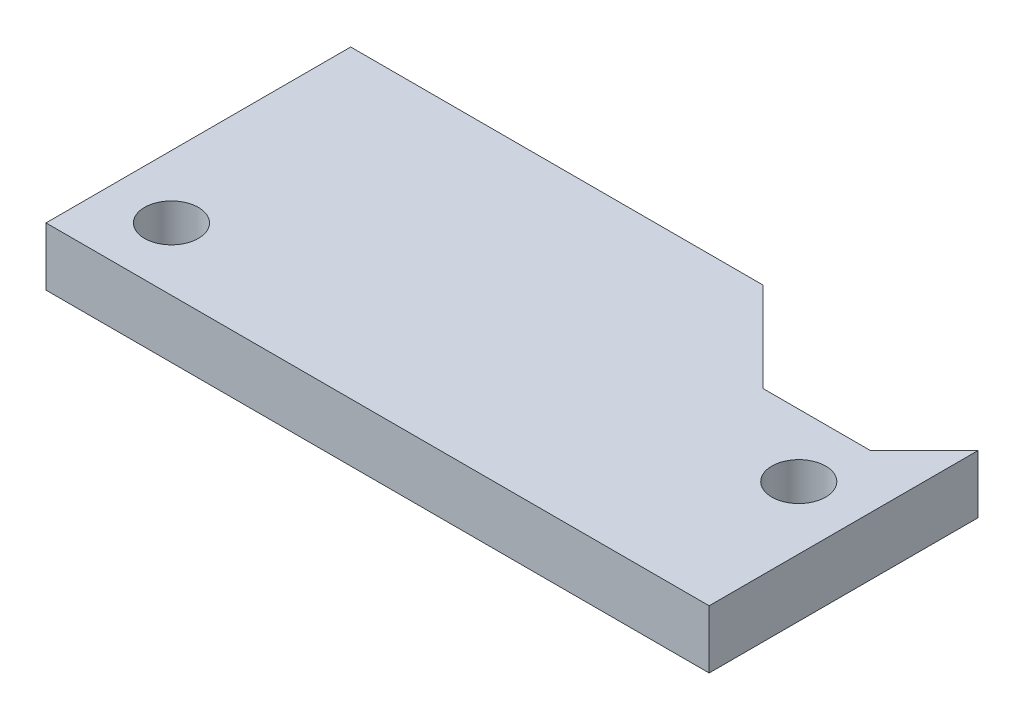
ISO-10303-21;
HEADER;
FILE_DESCRIPTION(('STEP AP214'),'2;1');
FILE_NAME('part.step','',(''),(''),'','','');
FILE_SCHEMA(('AUTOMOTIVE_DESIGN { 1 0 10303 214 1 1 1 1 }'));
ENDSEC;
DATA;
#1=APPLICATION_CONTEXT('core data for automotive mechanical design processes');
#2=APPLICATION_PROTOCOL_DEFINITION('international standard','automotive_design',2000,#1);
#3=PRODUCT_CONTEXT('',#1,'mechanical');
#4=PRODUCT('Part','Part','',(#3));
#5=PRODUCT_RELATED_PRODUCT_CATEGORY('part','',(#4));
#6=PRODUCT_DEFINITION_FORMATION('','',#4);
#7=PRODUCT_DEFINITION_CONTEXT('part definition',#1,'design');
#8=PRODUCT_DEFINITION('design','',#6,#7);
#9=PRODUCT_DEFINITION_SHAPE('','',#8);
#10=(LENGTH_UNIT() NAMED_UNIT(*) SI_UNIT(.MILLI.,.METRE.));
#11=(NAMED_UNIT(*) PLANE_ANGLE_UNIT() SI_UNIT($,.RADIAN.));
#12=(NAMED_UNIT(*) SI_UNIT($,.STERADIAN.) SOLID_ANGLE_UNIT());
#13=UNCERTAINTY_MEASURE_WITH_UNIT(LENGTH_MEASURE(1.E-05),#10,'distance_accuracy_value','');
#14=(GEOMETRIC_REPRESENTATION_CONTEXT(3) GLOBAL_UNCERTAINTY_ASSIGNED_CONTEXT((#13)) GLOBAL_UNIT_ASSIGNED_CONTEXT((#10,
#11,#12)) REPRESENTATION_CONTEXT('',''));
#15=CARTESIAN_POINT('',(0.,0.,0.));
#16=DIRECTION('',(0.,0.,1.));
#17=DIRECTION('',(1.,0.,0.));
#18=AXIS2_PLACEMENT_3D('',#15,#16,#17);
#19=CARTESIAN_POINT('',(0.,3.25,0.));
#20=DIRECTION('',(0.,1.,0.));
#21=DIRECTION('',(0.,0.,1.));
#22=AXIS2_PLACEMENT_3D('',#19,#20,#21);
#23=PLANE('',#22);
#24=CARTESIAN_POINT('',(-15.,3.25,5.00000000000001));
#25=DIRECTION('',(0.,1.,0.));
#26=DIRECTION('',(0.,0.,1.));
#27=AXIS2_PLACEMENT_3D('',#24,#25,#26);
#28=CIRCLE('',#27,1.5025);
#29=CARTESIAN_POINT('',(-15.,3.25,6.50250000000001));
#30=VERTEX_POINT('',#29);
#31=EDGE_CURVE('E129',#30,#30,#28,.T.);
#32=ORIENTED_EDGE('',*,*,#31,.F.);
#33=EDGE_LOOP('',(#32));
#34=FACE_BOUND('',#33,.T.);
#35=DIRECTION('',(0.,0.,1.));
#36=VECTOR('',#35,1.);
#37=CARTESIAN_POINT('',(-18.5,3.25,-8.49999999999999));
#38=LINE('',#37,#36);
#39=CARTESIAN_POINT('',(-18.5,3.25,-8.49999999999999));
#40=VERTEX_POINT('',#39);
#41=CARTESIAN_POINT('',(-18.5,3.25,8.50000000000001));
#42=VERTEX_POINT('',#41);
#43=EDGE_CURVE('E138',#40,#42,#38,.T.);
#44=ORIENTED_EDGE('',*,*,#43,.T.);
#45=DIRECTION('',(1.,0.,0.));
#46=VECTOR('',#45,1.);
#47=CARTESIAN_POINT('',(-18.5,3.25,8.50000000000001));
#48=LINE('',#47,#46);
#49=CARTESIAN_POINT('',(18.5,3.25,8.50000000000001));
#50=VERTEX_POINT('',#49);
#51=EDGE_CURVE('E91',#42,#50,#48,.T.);
#52=ORIENTED_EDGE('',*,*,#51,.T.);
#53=DIRECTION('',(0.,0.,-1.));
#54=VECTOR('',#53,1.);
#55=CARTESIAN_POINT('',(18.5,3.25,-6.49999999999999));
#56=LINE('',#55,#54);
#57=CARTESIAN_POINT('',(18.5,3.25,-6.49999999999999));
#58=VERTEX_POINT('',#57);
#59=EDGE_CURVE('E150',#50,#58,#56,.T.);
#60=ORIENTED_EDGE('',*,*,#59,.T.);
#61=DIRECTION('',(-0.707106781186548,0.,0.707106781186547));
#62=VECTOR('',#61,1.);
#63=CARTESIAN_POINT('',(15.5,3.25,-3.49999999999999));
#64=LINE('',#63,#62);
#65=CARTESIAN_POINT('',(15.5,3.25,-3.49999999999999));
#66=VERTEX_POINT('',#65);
#67=EDGE_CURVE('E107',#58,#66,#64,.T.);
#68=ORIENTED_EDGE('',*,*,#67,.T.);
#69=DIRECTION('',(-1.,0.,0.));
#70=VECTOR('',#69,1.);
#71=CARTESIAN_POINT('',(9.5,3.25,-3.49999999999999));
#72=LINE('',#71,#70);
#73=CARTESIAN_POINT('',(9.5,3.25,-3.49999999999999));
#74=VERTEX_POINT('',#73);
#75=EDGE_CURVE('E101',#66,#74,#72,.T.);
#76=ORIENTED_EDGE('',*,*,#75,.T.);
#77=DIRECTION('',(-0.707106781186547,0.,-0.707106781186548));
#78=VECTOR('',#77,1.);
#79=CARTESIAN_POINT('',(4.5,3.25,-8.49999999999999));
#80=LINE('',#79,#78);
#81=CARTESIAN_POINT('',(4.5,3.25,-8.49999999999999));
#82=VERTEX_POINT('',#81);
#83=EDGE_CURVE('E105',#74,#82,#80,.T.);
#84=ORIENTED_EDGE('',*,*,#83,.T.);
#85=DIRECTION('',(-1.,0.,0.));
#86=VECTOR('',#85,1.);
#87=CARTESIAN_POINT('',(-18.5,3.25,-8.49999999999999));
#88=LINE('',#87,#86);
#89=EDGE_CURVE('E51',#82,#40,#88,.T.);
#90=ORIENTED_EDGE('',*,*,#89,.T.);
#91=EDGE_LOOP('',(#44,#52,#60,#68,#76,#84,#90));
#92=FACE_BOUND('',#91,.T.);
#93=CARTESIAN_POINT('',(15.,3.25,0.));
#94=DIRECTION('',(0.,1.,0.));
#95=DIRECTION('',(0.,0.,1.));
#96=AXIS2_PLACEMENT_3D('',#93,#94,#95);
#97=CIRCLE('',#96,1.5025);
#98=CARTESIAN_POINT('',(15.,3.25,1.50250000000001));
#99=VERTEX_POINT('',#98);
#100=EDGE_CURVE('E165',#99,#99,#97,.T.);
#101=ORIENTED_EDGE('',*,*,#100,.F.);
#102=EDGE_LOOP('',(#101));
#103=FACE_BOUND('',#102,.T.);
#104=ADVANCED_FACE('F34',(#34,#92,#103),#23,.T.);
#105=CARTESIAN_POINT('',(0.,0.,0.));
#106=DIRECTION('',(0.,1.,0.));
#107=DIRECTION('',(0.,0.,1.));
#108=AXIS2_PLACEMENT_3D('',#105,#106,#107);
#109=PLANE('',#108);
#110=DIRECTION('',(0.,0.,1.));
#111=VECTOR('',#110,1.);
#112=CARTESIAN_POINT('',(-18.5,0.,-8.49999999999999));
#113=LINE('',#112,#111);
#114=CARTESIAN_POINT('',(-18.5,0.,-8.49999999999999));
#115=VERTEX_POINT('',#114);
#116=CARTESIAN_POINT('',(-18.5,0.,8.50000000000001));
#117=VERTEX_POINT('',#116);
#118=EDGE_CURVE('E125',#115,#117,#113,.T.);
#119=ORIENTED_EDGE('',*,*,#118,.F.);
#120=DIRECTION('',(-1.,0.,0.));
#121=VECTOR('',#120,1.);
#122=CARTESIAN_POINT('',(-18.5,0.,-8.49999999999999));
#123=LINE('',#122,#121);
#124=CARTESIAN_POINT('',(4.5,0.,-8.49999999999999));
#125=VERTEX_POINT('',#124);
#126=EDGE_CURVE('E83',#125,#115,#123,.T.);
#127=ORIENTED_EDGE('',*,*,#126,.F.);
#128=DIRECTION('',(-0.707106781186547,0.,-0.707106781186548));
#129=VECTOR('',#128,1.);
#130=CARTESIAN_POINT('',(4.5,0.,-8.49999999999999));
#131=LINE('',#130,#129);
#132=CARTESIAN_POINT('',(9.5,0.,-3.49999999999999));
#133=VERTEX_POINT('',#132);
#134=EDGE_CURVE('E77',#133,#125,#131,.T.);
#135=ORIENTED_EDGE('',*,*,#134,.F.);
#136=DIRECTION('',(-1.,0.,0.));
#137=VECTOR('',#136,1.);
#138=CARTESIAN_POINT('',(9.5,0.,-3.49999999999999));
#139=LINE('',#138,#137);
#140=CARTESIAN_POINT('',(15.5,0.,-3.49999999999999));
#141=VERTEX_POINT('',#140);
#142=EDGE_CURVE('E115',#141,#133,#139,.T.);
#143=ORIENTED_EDGE('',*,*,#142,.F.);
#144=DIRECTION('',(-0.707106781186548,0.,0.707106781186547));
#145=VECTOR('',#144,1.);
#146=CARTESIAN_POINT('',(15.5,0.,-3.49999999999999));
#147=LINE('',#146,#145);
#148=CARTESIAN_POINT('',(18.5,0.,-6.49999999999999));
#149=VERTEX_POINT('',#148);
#150=EDGE_CURVE('E133',#149,#141,#147,.T.);
#151=ORIENTED_EDGE('',*,*,#150,.F.);
#152=DIRECTION('',(0.,0.,-1.));
#153=VECTOR('',#152,1.);
#154=CARTESIAN_POINT('',(18.5,0.,-6.49999999999999));
#155=LINE('',#154,#153);
#156=CARTESIAN_POINT('',(18.5,0.,8.50000000000001));
#157=VERTEX_POINT('',#156);
#158=EDGE_CURVE('E131',#157,#149,#155,.T.);
#159=ORIENTED_EDGE('',*,*,#158,.F.);
#160=DIRECTION('',(1.,0.,0.));
#161=VECTOR('',#160,1.);
#162=CARTESIAN_POINT('',(-18.5,0.,8.50000000000001));
#163=LINE('',#162,#161);
#164=EDGE_CURVE('E128',#117,#157,#163,.T.);
#165=ORIENTED_EDGE('',*,*,#164,.F.);
#166=EDGE_LOOP('',(#119,#127,#135,#143,#151,#159,#165));
#167=FACE_BOUND('',#166,.T.);
#168=CARTESIAN_POINT('',(-15.,0.,5.00000000000001));
#169=DIRECTION('',(0.,1.,0.));
#170=DIRECTION('',(0.,0.,1.));
#171=AXIS2_PLACEMENT_3D('',#168,#169,#170);
#172=CIRCLE('',#171,1.5025);
#173=CARTESIAN_POINT('',(-15.,0.,6.50250000000001));
#174=VERTEX_POINT('',#173);
#175=EDGE_CURVE('E162',#174,#174,#172,.T.);
#176=ORIENTED_EDGE('',*,*,#175,.T.);
#177=EDGE_LOOP('',(#176));
#178=FACE_BOUND('',#177,.T.);
#179=CARTESIAN_POINT('',(15.,0.,0.));
#180=DIRECTION('',(0.,1.,0.));
#181=DIRECTION('',(0.,0.,1.));
#182=AXIS2_PLACEMENT_3D('',#179,#180,#181);
#183=CIRCLE('',#182,1.5025);
#184=CARTESIAN_POINT('',(15.,0.,1.50250000000001));
#185=VERTEX_POINT('',#184);
#186=EDGE_CURVE('E168',#185,#185,#183,.T.);
#187=ORIENTED_EDGE('',*,*,#186,.T.);
#188=EDGE_LOOP('',(#187));
#189=FACE_BOUND('',#188,.T.);
#190=ADVANCED_FACE('F154',(#167,#178,#189),#109,.F.);
#191=CARTESIAN_POINT('',(-18.5,3.25,-8.49999999999999));
#192=DIRECTION('',(1.,0.,0.));
#193=DIRECTION('',(0.,0.,-1.));
#194=AXIS2_PLACEMENT_3D('',#191,#192,#193);
#195=PLANE('',#194);
#196=ORIENTED_EDGE('',*,*,#118,.T.);
#197=DIRECTION('',(0.,-1.,0.));
#198=VECTOR('',#197,1.);
#199=CARTESIAN_POINT('',(-18.5,3.25,8.50000000000001));
#200=LINE('',#199,#198);
#201=EDGE_CURVE('E11',#42,#117,#200,.T.);
#202=ORIENTED_EDGE('',*,*,#201,.F.);
#203=ORIENTED_EDGE('',*,*,#43,.F.);
#204=DIRECTION('',(0.,-1.,0.));
#205=VECTOR('',#204,1.);
#206=CARTESIAN_POINT('',(-18.5,3.25,-8.49999999999999));
#207=LINE('',#206,#205);
#208=EDGE_CURVE('E121',#40,#115,#207,.T.);
#209=ORIENTED_EDGE('',*,*,#208,.T.);
#210=EDGE_LOOP('',(#196,#202,#203,#209));
#211=FACE_BOUND('',#210,.T.);
#212=ADVANCED_FACE('F36',(#211),#195,.F.);
#213=CARTESIAN_POINT('',(-18.5,3.25,8.50000000000001));
#214=DIRECTION('',(0.,0.,-1.));
#215=DIRECTION('',(-1.,0.,0.));
#216=AXIS2_PLACEMENT_3D('',#213,#214,#215);
#217=PLANE('',#216);
#218=ORIENTED_EDGE('',*,*,#164,.T.);
#219=DIRECTION('',(0.,-1.,0.));
#220=VECTOR('',#219,1.);
#221=CARTESIAN_POINT('',(18.5,3.25,8.50000000000001));
#222=LINE('',#221,#220);
#223=EDGE_CURVE('E43',#50,#157,#222,.T.);
#224=ORIENTED_EDGE('',*,*,#223,.F.);
#225=ORIENTED_EDGE('',*,*,#51,.F.);
#226=ORIENTED_EDGE('',*,*,#201,.T.);
#227=EDGE_LOOP('',(#218,#224,#225,#226));
#228=FACE_BOUND('',#227,.T.);
#229=ADVANCED_FACE('F198',(#228),#217,.F.);
#230=CARTESIAN_POINT('',(18.5,3.25,-6.49999999999999));
#231=DIRECTION('',(-1.,0.,0.));
#232=DIRECTION('',(0.,0.,1.));
#233=AXIS2_PLACEMENT_3D('',#230,#231,#232);
#234=PLANE('',#233);
#235=ORIENTED_EDGE('',*,*,#158,.T.);
#236=DIRECTION('',(0.,-1.,0.));
#237=VECTOR('',#236,1.);
#238=CARTESIAN_POINT('',(18.5,3.25,-6.49999999999999));
#239=LINE('',#238,#237);
#240=EDGE_CURVE('E142',#58,#149,#239,.T.);
#241=ORIENTED_EDGE('',*,*,#240,.F.);
#242=ORIENTED_EDGE('',*,*,#59,.F.);
#243=ORIENTED_EDGE('',*,*,#223,.T.);
#244=EDGE_LOOP('',(#235,#241,#242,#243));
#245=FACE_BOUND('',#244,.T.);
#246=ADVANCED_FACE('F148',(#245),#234,.F.);
#247=CARTESIAN_POINT('',(15.5,3.25,-3.49999999999999));
#248=DIRECTION('',(0.707106781186547,0.,0.707106781186548));
#249=DIRECTION('',(0.707106781186548,0.,-0.707106781186547));
#250=AXIS2_PLACEMENT_3D('',#247,#248,#249);
#251=PLANE('',#250);
#252=ORIENTED_EDGE('',*,*,#150,.T.);
#253=DIRECTION('',(0.,-1.,0.));
#254=VECTOR('',#253,1.);
#255=CARTESIAN_POINT('',(15.5,3.25,-3.49999999999999));
#256=LINE('',#255,#254);
#257=EDGE_CURVE('E116',#66,#141,#256,.T.);
#258=ORIENTED_EDGE('',*,*,#257,.F.);
#259=ORIENTED_EDGE('',*,*,#67,.F.);
#260=ORIENTED_EDGE('',*,*,#240,.T.);
#261=EDGE_LOOP('',(#252,#258,#259,#260));
#262=FACE_BOUND('',#261,.T.);
#263=ADVANCED_FACE('F157',(#262),#251,.F.);
#264=CARTESIAN_POINT('',(9.5,3.25,-3.49999999999999));
#265=DIRECTION('',(0.,0.,1.));
#266=DIRECTION('',(1.,0.,0.));
#267=AXIS2_PLACEMENT_3D('',#264,#265,#266);
#268=PLANE('',#267);
#269=ORIENTED_EDGE('',*,*,#142,.T.);
#270=DIRECTION('',(0.,-1.,0.));
#271=VECTOR('',#270,1.);
#272=CARTESIAN_POINT('',(9.5,3.25,-3.49999999999999));
#273=LINE('',#272,#271);
#274=EDGE_CURVE('E112',#74,#133,#273,.T.);
#275=ORIENTED_EDGE('',*,*,#274,.F.);
#276=ORIENTED_EDGE('',*,*,#75,.F.);
#277=ORIENTED_EDGE('',*,*,#257,.T.);
#278=EDGE_LOOP('',(#269,#275,#276,#277));
#279=FACE_BOUND('',#278,.T.);
#280=ADVANCED_FACE('F113',(#279),#268,.F.);
#281=CARTESIAN_POINT('',(4.5,3.25,-8.49999999999999));
#282=DIRECTION('',(-0.707106781186548,0.,0.707106781186547));
#283=DIRECTION('',(0.707106781186547,0.,0.707106781186548));
#284=AXIS2_PLACEMENT_3D('',#281,#282,#283);
#285=PLANE('',#284);
#286=ORIENTED_EDGE('',*,*,#134,.T.);
#287=DIRECTION('',(0.,-1.,0.));
#288=VECTOR('',#287,1.);
#289=CARTESIAN_POINT('',(4.5,3.25,-8.49999999999999));
#290=LINE('',#289,#288);
#291=EDGE_CURVE('E117',#82,#125,#290,.T.);
#292=ORIENTED_EDGE('',*,*,#291,.F.);
#293=ORIENTED_EDGE('',*,*,#83,.F.);
#294=ORIENTED_EDGE('',*,*,#274,.T.);
#295=EDGE_LOOP('',(#286,#292,#293,#294));
#296=FACE_BOUND('',#295,.T.);
#297=ADVANCED_FACE('F119',(#296),#285,.F.);
#298=CARTESIAN_POINT('',(-18.5,3.25,-8.49999999999999));
#299=DIRECTION('',(0.,0.,1.));
#300=DIRECTION('',(1.,0.,0.));
#301=AXIS2_PLACEMENT_3D('',#298,#299,#300);
#302=PLANE('',#301);
#303=ORIENTED_EDGE('',*,*,#126,.T.);
#304=ORIENTED_EDGE('',*,*,#208,.F.);
#305=ORIENTED_EDGE('',*,*,#89,.F.);
#306=ORIENTED_EDGE('',*,*,#291,.T.);
#307=EDGE_LOOP('',(#303,#304,#305,#306));
#308=FACE_BOUND('',#307,.T.);
#309=ADVANCED_FACE('F188',(#308),#302,.F.);
#310=CARTESIAN_POINT('',(-15.,3.25,5.00000000000001));
#311=DIRECTION('',(0.,-1.,0.));
#312=DIRECTION('',(0.,0.,-1.));
#313=AXIS2_PLACEMENT_3D('',#310,#311,#312);
#314=CYLINDRICAL_SURFACE('',#313,1.5025);
#315=ORIENTED_EDGE('',*,*,#31,.T.);
#316=EDGE_LOOP('',(#315));
#317=FACE_BOUND('',#316,.T.);
#318=ORIENTED_EDGE('',*,*,#175,.F.);
#319=EDGE_LOOP('',(#318));
#320=FACE_BOUND('',#319,.T.);
#321=ADVANCED_FACE('F185',(#317,#320),#314,.F.);
#322=CARTESIAN_POINT('',(15.,3.25,0.));
#323=DIRECTION('',(0.,-1.,0.));
#324=DIRECTION('',(0.,0.,-1.));
#325=AXIS2_PLACEMENT_3D('',#322,#323,#324);
#326=CYLINDRICAL_SURFACE('',#325,1.5025);
#327=ORIENTED_EDGE('',*,*,#100,.T.);
#328=EDGE_LOOP('',(#327));
#329=FACE_BOUND('',#328,.T.);
#330=ORIENTED_EDGE('',*,*,#186,.F.);
#331=EDGE_LOOP('',(#330));
#332=FACE_BOUND('',#331,.T.);
#333=ADVANCED_FACE('F174',(#329,#332),#326,.F.);
#334=CLOSED_SHELL('',(#104,#190,#212,#229,#246,#263,#280,#297,#309,#321,#333));
#335=MANIFOLD_SOLID_BREP('B2',#334);
#336=ADVANCED_BREP_SHAPE_REPRESENTATION('',(#18,#335),#14);
#337=SHAPE_DEFINITION_REPRESENTATION(#9,#336);
ENDSEC;
END-ISO-10303-21;
